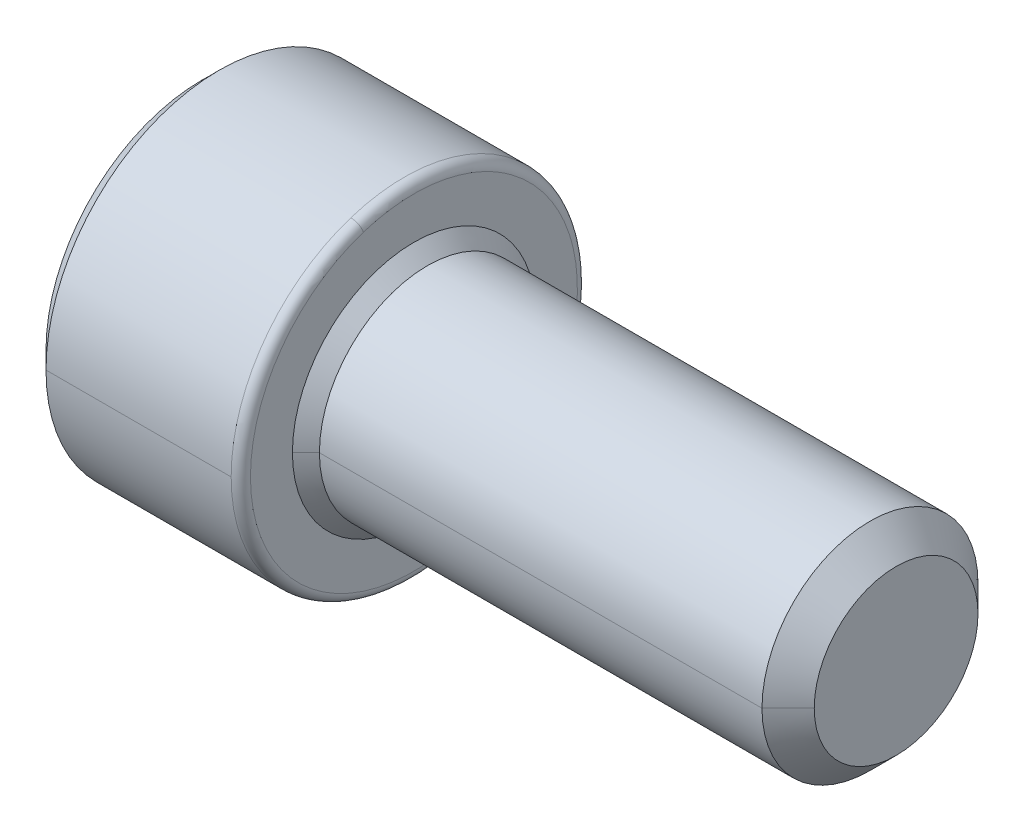
ISO-10303-21;
HEADER;
FILE_DESCRIPTION(('STEP AP214'),'2;1');
FILE_NAME('part.step','',(''),(''),'','','');
FILE_SCHEMA(('AUTOMOTIVE_DESIGN { 1 0 10303 214 1 1 1 1 }'));
ENDSEC;
DATA;
#1=APPLICATION_CONTEXT('core data for automotive mechanical design processes');
#2=APPLICATION_PROTOCOL_DEFINITION('international standard','automotive_design',2000,#1);
#3=PRODUCT_CONTEXT('',#1,'mechanical');
#4=PRODUCT('Part','Part','',(#3));
#5=PRODUCT_RELATED_PRODUCT_CATEGORY('part','',(#4));
#6=PRODUCT_DEFINITION_FORMATION('','',#4);
#7=PRODUCT_DEFINITION_CONTEXT('part definition',#1,'design');
#8=PRODUCT_DEFINITION('design','',#6,#7);
#9=PRODUCT_DEFINITION_SHAPE('','',#8);
#10=(LENGTH_UNIT() NAMED_UNIT(*) SI_UNIT(.MILLI.,.METRE.));
#11=(NAMED_UNIT(*) PLANE_ANGLE_UNIT() SI_UNIT($,.RADIAN.));
#12=(NAMED_UNIT(*) SI_UNIT($,.STERADIAN.) SOLID_ANGLE_UNIT());
#13=UNCERTAINTY_MEASURE_WITH_UNIT(LENGTH_MEASURE(1.E-05),#10,'distance_accuracy_value','');
#14=(GEOMETRIC_REPRESENTATION_CONTEXT(3) GLOBAL_UNCERTAINTY_ASSIGNED_CONTEXT((#13)) GLOBAL_UNIT_ASSIGNED_CONTEXT((#10,
#11,#12)) REPRESENTATION_CONTEXT('',''));
#15=CARTESIAN_POINT('',(0.,0.,0.));
#16=DIRECTION('',(0.,0.,1.));
#17=DIRECTION('',(1.,0.,0.));
#18=AXIS2_PLACEMENT_3D('',#15,#16,#17);
#19=CARTESIAN_POINT('',(-2.794,1.199515,0.));
#20=DIRECTION('',(1.,0.,0.));
#21=DIRECTION('',(0.,0.,-1.));
#22=AXIS2_PLACEMENT_3D('',#19,#20,#21);
#23=PLANE('',#22);
#24=CARTESIAN_POINT('',(-2.794,0.,0.));
#25=DIRECTION('',(1.,0.,0.));
#26=DIRECTION('',(0.,0.,-1.));
#27=AXIS2_PLACEMENT_3D('',#24,#25,#26);
#28=CIRCLE('',#27,2.05105);
#29=CARTESIAN_POINT('',(-2.794,0.,2.05105));
#30=VERTEX_POINT('',#29);
#31=CARTESIAN_POINT('',(-2.794,0.,-2.05105));
#32=VERTEX_POINT('',#31);
#33=EDGE_CURVE('E11',#30,#32,#28,.T.);
#34=ORIENTED_EDGE('',*,*,#33,.F.);
#35=CARTESIAN_POINT('',(-2.794,0.,0.));
#36=DIRECTION('',(1.,0.,0.));
#37=DIRECTION('',(0.,0.,-1.));
#38=AXIS2_PLACEMENT_3D('',#35,#36,#37);
#39=CIRCLE('',#38,2.05105);
#40=EDGE_CURVE('E25',#32,#30,#39,.T.);
#41=ORIENTED_EDGE('',*,*,#40,.F.);
#42=EDGE_LOOP('',(#34,#41));
#43=FACE_BOUND('',#42,.T.);
#44=DIRECTION('',(0.,-0.500000000000009,0.866025403784434));
#45=VECTOR('',#44,1.);
#46=CARTESIAN_POINT('',(-2.794,-0.738931712220478,-1.11916273111026));
#47=LINE('',#46,#45);
#48=CARTESIAN_POINT('',(-2.794,-0.69254030814699,-1.199515));
#49=VERTEX_POINT('',#48);
#50=CARTESIAN_POINT('',(-2.794,-1.385080616294,0.));
#51=VERTEX_POINT('',#50);
#52=EDGE_CURVE('E520',#49,#51,#47,.T.);
#53=ORIENTED_EDGE('',*,*,#52,.F.);
#54=DIRECTION('',(0.,-1.,0.));
#55=VECTOR('',#54,1.);
#56=CARTESIAN_POINT('',(-2.794,1.199515,-1.199515));
#57=LINE('',#56,#55);
#58=CARTESIAN_POINT('',(-2.794,0.69254030814699,-1.199515));
#59=VERTEX_POINT('',#58);
#60=EDGE_CURVE('E515',#59,#49,#57,.T.);
#61=ORIENTED_EDGE('',*,*,#60,.F.);
#62=DIRECTION('',(0.,-0.500000000000009,-0.866025403784434));
#63=VECTOR('',#62,1.);
#64=CARTESIAN_POINT('',(-2.794,1.3386892122205,-0.0803522688897606));
#65=LINE('',#64,#63);
#66=CARTESIAN_POINT('',(-2.794,1.385080616294,0.));
#67=VERTEX_POINT('',#66);
#68=EDGE_CURVE('E510',#67,#59,#65,.T.);
#69=ORIENTED_EDGE('',*,*,#68,.F.);
#70=DIRECTION('',(0.,0.500000000000009,-0.866025403784434));
#71=VECTOR('',#70,1.);
#72=CARTESIAN_POINT('',(-2.794,1.3386892122205,0.0803522688897606));
#73=LINE('',#72,#71);
#74=CARTESIAN_POINT('',(-2.794,0.69254030814699,1.199515));
#75=VERTEX_POINT('',#74);
#76=EDGE_CURVE('E505',#75,#67,#73,.T.);
#77=ORIENTED_EDGE('',*,*,#76,.F.);
#78=DIRECTION('',(0.,1.,0.));
#79=VECTOR('',#78,1.);
#80=CARTESIAN_POINT('',(-2.794,1.199515,1.199515));
#81=LINE('',#80,#79);
#82=CARTESIAN_POINT('',(-2.794,-0.69254030814699,1.199515));
#83=VERTEX_POINT('',#82);
#84=EDGE_CURVE('E500',#83,#75,#81,.T.);
#85=ORIENTED_EDGE('',*,*,#84,.F.);
#86=DIRECTION('',(0.,0.500000000000009,0.866025403784434));
#87=VECTOR('',#86,1.);
#88=CARTESIAN_POINT('',(-2.794,-0.738931712220478,1.11916273111026));
#89=LINE('',#88,#87);
#90=EDGE_CURVE('E495',#51,#83,#89,.T.);
#91=ORIENTED_EDGE('',*,*,#90,.F.);
#92=EDGE_LOOP('',(#53,#61,#69,#77,#85,#91));
#93=FACE_BOUND('',#92,.T.);
#94=ADVANCED_FACE('F17',(#43,#93),#23,.F.);
#95=CARTESIAN_POINT('',(-1.4986,-0.69254030814699,1.199515));
#96=DIRECTION('',(0.,0.866025403784434,-0.500000000000009));
#97=DIRECTION('',(0.,0.500000000000009,0.866025403784434));
#98=AXIS2_PLACEMENT_3D('',#95,#96,#97);
#99=PLANE('',#98);
#100=DIRECTION('',(0.,-0.500000000000009,-0.866025403784434));
#101=VECTOR('',#100,1.);
#102=CARTESIAN_POINT('',(-1.4986,-0.69254030814699,1.199515));
#103=LINE('',#102,#101);
#104=CARTESIAN_POINT('',(-1.4986,-0.69254030814699,1.199515));
#105=VERTEX_POINT('',#104);
#106=CARTESIAN_POINT('',(-1.4986,-1.03881046222049,0.599757500000012));
#107=VERTEX_POINT('',#106);
#108=EDGE_CURVE('E491',#105,#107,#103,.T.);
#109=ORIENTED_EDGE('',*,*,#108,.T.);
#110=DIRECTION('',(0.,-0.500000000000009,-0.866025403784434));
#111=VECTOR('',#110,1.);
#112=CARTESIAN_POINT('',(-1.4986,-0.69254030814699,1.199515));
#113=LINE('',#112,#111);
#114=CARTESIAN_POINT('',(-1.4986,-1.385080616294,0.));
#115=VERTEX_POINT('',#114);
#116=EDGE_CURVE('E487',#107,#115,#113,.T.);
#117=ORIENTED_EDGE('',*,*,#116,.T.);
#118=DIRECTION('',(-1.,0.,0.));
#119=VECTOR('',#118,1.);
#120=CARTESIAN_POINT('',(-1.4986,-1.385080616294,0.));
#121=LINE('',#120,#119);
#122=EDGE_CURVE('E482',#115,#51,#121,.T.);
#123=ORIENTED_EDGE('',*,*,#122,.T.);
#124=ORIENTED_EDGE('',*,*,#90,.T.);
#125=DIRECTION('',(-1.,0.,0.));
#126=VECTOR('',#125,1.);
#127=CARTESIAN_POINT('',(-1.4986,-0.69254030814699,1.199515));
#128=LINE('',#127,#126);
#129=EDGE_CURVE('E477',#105,#83,#128,.T.);
#130=ORIENTED_EDGE('',*,*,#129,.F.);
#131=EDGE_LOOP('',(#109,#117,#123,#124,#130));
#132=FACE_BOUND('',#131,.T.);
#133=ADVANCED_FACE('F569',(#132),#99,.T.);
#134=CARTESIAN_POINT('',(-1.4986,0.69254030814699,1.199515));
#135=DIRECTION('',(0.,0.,-1.));
#136=DIRECTION('',(-1.,0.,0.));
#137=AXIS2_PLACEMENT_3D('',#134,#135,#136);
#138=PLANE('',#137);
#139=DIRECTION('',(0.,-1.,0.));
#140=VECTOR('',#139,1.);
#141=CARTESIAN_POINT('',(-1.4986,0.69254030814699,1.199515));
#142=LINE('',#141,#140);
#143=CARTESIAN_POINT('',(-1.4986,0.69254030814699,1.199515));
#144=VERTEX_POINT('',#143);
#145=CARTESIAN_POINT('',(-1.4986,0.,1.199515));
#146=VERTEX_POINT('',#145);
#147=EDGE_CURVE('E473',#144,#146,#142,.T.);
#148=ORIENTED_EDGE('',*,*,#147,.T.);
#149=DIRECTION('',(0.,-1.,0.));
#150=VECTOR('',#149,1.);
#151=CARTESIAN_POINT('',(-1.4986,0.69254030814699,1.199515));
#152=LINE('',#151,#150);
#153=EDGE_CURVE('E468',#146,#105,#152,.T.);
#154=ORIENTED_EDGE('',*,*,#153,.T.);
#155=ORIENTED_EDGE('',*,*,#129,.T.);
#156=ORIENTED_EDGE('',*,*,#84,.T.);
#157=DIRECTION('',(-1.,0.,0.));
#158=VECTOR('',#157,1.);
#159=CARTESIAN_POINT('',(-1.4986,0.69254030814699,1.199515));
#160=LINE('',#159,#158);
#161=EDGE_CURVE('E463',#144,#75,#160,.T.);
#162=ORIENTED_EDGE('',*,*,#161,.F.);
#163=EDGE_LOOP('',(#148,#154,#155,#156,#162));
#164=FACE_BOUND('',#163,.T.);
#165=ADVANCED_FACE('F573',(#164),#138,.T.);
#166=CARTESIAN_POINT('',(-1.4986,1.385080616294,0.));
#167=DIRECTION('',(0.,-0.866025403784434,-0.500000000000009));
#168=DIRECTION('',(0.,0.500000000000009,-0.866025403784434));
#169=AXIS2_PLACEMENT_3D('',#166,#167,#168);
#170=PLANE('',#169);
#171=DIRECTION('',(0.,-0.500000000000009,0.866025403784434));
#172=VECTOR('',#171,1.);
#173=CARTESIAN_POINT('',(-1.4986,1.385080616294,0.));
#174=LINE('',#173,#172);
#175=CARTESIAN_POINT('',(-1.4986,1.385080616294,0.));
#176=VERTEX_POINT('',#175);
#177=CARTESIAN_POINT('',(-1.4986,1.03881046222049,0.599757500000012));
#178=VERTEX_POINT('',#177);
#179=EDGE_CURVE('E459',#176,#178,#174,.T.);
#180=ORIENTED_EDGE('',*,*,#179,.T.);
#181=DIRECTION('',(0.,-0.500000000000009,0.866025403784434));
#182=VECTOR('',#181,1.);
#183=CARTESIAN_POINT('',(-1.4986,1.385080616294,0.));
#184=LINE('',#183,#182);
#185=EDGE_CURVE('E454',#178,#144,#184,.T.);
#186=ORIENTED_EDGE('',*,*,#185,.T.);
#187=ORIENTED_EDGE('',*,*,#161,.T.);
#188=ORIENTED_EDGE('',*,*,#76,.T.);
#189=DIRECTION('',(-1.,0.,0.));
#190=VECTOR('',#189,1.);
#191=CARTESIAN_POINT('',(-1.4986,1.385080616294,0.));
#192=LINE('',#191,#190);
#193=EDGE_CURVE('E449',#176,#67,#192,.T.);
#194=ORIENTED_EDGE('',*,*,#193,.F.);
#195=EDGE_LOOP('',(#180,#186,#187,#188,#194));
#196=FACE_BOUND('',#195,.T.);
#197=ADVANCED_FACE('F588',(#196),#170,.T.);
#198=CARTESIAN_POINT('',(-1.4986,0.69254030814699,-1.199515));
#199=DIRECTION('',(0.,-0.866025403784434,0.500000000000009));
#200=DIRECTION('',(0.,-0.500000000000009,-0.866025403784434));
#201=AXIS2_PLACEMENT_3D('',#198,#199,#200);
#202=PLANE('',#201);
#203=DIRECTION('',(0.,0.500000000000009,0.866025403784434));
#204=VECTOR('',#203,1.);
#205=CARTESIAN_POINT('',(-1.4986,0.69254030814699,-1.199515));
#206=LINE('',#205,#204);
#207=CARTESIAN_POINT('',(-1.4986,0.69254030814699,-1.199515));
#208=VERTEX_POINT('',#207);
#209=CARTESIAN_POINT('',(-1.4986,1.03881046222049,-0.599757500000012));
#210=VERTEX_POINT('',#209);
#211=EDGE_CURVE('E445',#208,#210,#206,.T.);
#212=ORIENTED_EDGE('',*,*,#211,.T.);
#213=DIRECTION('',(0.,0.500000000000009,0.866025403784434));
#214=VECTOR('',#213,1.);
#215=CARTESIAN_POINT('',(-1.4986,0.69254030814699,-1.199515));
#216=LINE('',#215,#214);
#217=EDGE_CURVE('E440',#210,#176,#216,.T.);
#218=ORIENTED_EDGE('',*,*,#217,.T.);
#219=ORIENTED_EDGE('',*,*,#193,.T.);
#220=ORIENTED_EDGE('',*,*,#68,.T.);
#221=DIRECTION('',(-1.,0.,0.));
#222=VECTOR('',#221,1.);
#223=CARTESIAN_POINT('',(-1.4986,0.69254030814699,-1.199515));
#224=LINE('',#223,#222);
#225=EDGE_CURVE('E435',#208,#59,#224,.T.);
#226=ORIENTED_EDGE('',*,*,#225,.F.);
#227=EDGE_LOOP('',(#212,#218,#219,#220,#226));
#228=FACE_BOUND('',#227,.T.);
#229=ADVANCED_FACE('F586',(#228),#202,.T.);
#230=CARTESIAN_POINT('',(-1.4986,-0.69254030814699,-1.199515));
#231=DIRECTION('',(0.,0.,1.));
#232=DIRECTION('',(1.,0.,0.));
#233=AXIS2_PLACEMENT_3D('',#230,#231,#232);
#234=PLANE('',#233);
#235=DIRECTION('',(0.,1.,0.));
#236=VECTOR('',#235,1.);
#237=CARTESIAN_POINT('',(-1.4986,-0.69254030814699,-1.199515));
#238=LINE('',#237,#236);
#239=CARTESIAN_POINT('',(-1.4986,-0.69254030814699,-1.199515));
#240=VERTEX_POINT('',#239);
#241=CARTESIAN_POINT('',(-1.4986,0.,-1.199515));
#242=VERTEX_POINT('',#241);
#243=EDGE_CURVE('E431',#240,#242,#238,.T.);
#244=ORIENTED_EDGE('',*,*,#243,.T.);
#245=DIRECTION('',(0.,1.,0.));
#246=VECTOR('',#245,1.);
#247=CARTESIAN_POINT('',(-1.4986,-0.69254030814699,-1.199515));
#248=LINE('',#247,#246);
#249=EDGE_CURVE('E426',#242,#208,#248,.T.);
#250=ORIENTED_EDGE('',*,*,#249,.T.);
#251=ORIENTED_EDGE('',*,*,#225,.T.);
#252=ORIENTED_EDGE('',*,*,#60,.T.);
#253=DIRECTION('',(-1.,0.,0.));
#254=VECTOR('',#253,1.);
#255=CARTESIAN_POINT('',(-1.4986,-0.69254030814699,-1.199515));
#256=LINE('',#255,#254);
#257=EDGE_CURVE('E421',#240,#49,#256,.T.);
#258=ORIENTED_EDGE('',*,*,#257,.F.);
#259=EDGE_LOOP('',(#244,#250,#251,#252,#258));
#260=FACE_BOUND('',#259,.T.);
#261=ADVANCED_FACE('F582',(#260),#234,.T.);
#262=CARTESIAN_POINT('',(-1.4986,-1.385080616294,0.));
#263=DIRECTION('',(0.,0.866025403784434,0.500000000000009));
#264=DIRECTION('',(0.,-0.500000000000009,0.866025403784434));
#265=AXIS2_PLACEMENT_3D('',#262,#263,#264);
#266=PLANE('',#265);
#267=DIRECTION('',(0.,0.500000000000009,-0.866025403784434));
#268=VECTOR('',#267,1.);
#269=CARTESIAN_POINT('',(-1.4986,-1.385080616294,0.));
#270=LINE('',#269,#268);
#271=CARTESIAN_POINT('',(-1.4986,-1.03881046222049,-0.599757500000012));
#272=VERTEX_POINT('',#271);
#273=EDGE_CURVE('E417',#115,#272,#270,.T.);
#274=ORIENTED_EDGE('',*,*,#273,.T.);
#275=DIRECTION('',(0.,0.500000000000009,-0.866025403784434));
#276=VECTOR('',#275,1.);
#277=CARTESIAN_POINT('',(-1.4986,-1.385080616294,0.));
#278=LINE('',#277,#276);
#279=EDGE_CURVE('E412',#272,#240,#278,.T.);
#280=ORIENTED_EDGE('',*,*,#279,.T.);
#281=ORIENTED_EDGE('',*,*,#257,.T.);
#282=ORIENTED_EDGE('',*,*,#52,.T.);
#283=ORIENTED_EDGE('',*,*,#122,.F.);
#284=EDGE_LOOP('',(#274,#280,#281,#282,#283));
#285=FACE_BOUND('',#284,.T.);
#286=ADVANCED_FACE('F578',(#285),#266,.T.);
#287=CARTESIAN_POINT('',(-1.4986,0.,0.));
#288=DIRECTION('',(1.,0.,0.));
#289=DIRECTION('',(0.,0.,-1.));
#290=AXIS2_PLACEMENT_3D('',#287,#288,#289);
#291=PLANE('',#290);
#292=ORIENTED_EDGE('',*,*,#243,.F.);
#293=ORIENTED_EDGE('',*,*,#279,.F.);
#294=CARTESIAN_POINT('',(-1.4986,0.,0.));
#295=DIRECTION('',(1.,0.,0.));
#296=DIRECTION('',(0.,0.,-1.));
#297=AXIS2_PLACEMENT_3D('',#294,#295,#296);
#298=CIRCLE('',#297,1.199515);
#299=EDGE_CURVE('E407',#272,#242,#298,.T.);
#300=ORIENTED_EDGE('',*,*,#299,.T.);
#301=EDGE_LOOP('',(#292,#293,#300));
#302=FACE_BOUND('',#301,.T.);
#303=ADVANCED_FACE('F371',(#302),#291,.F.);
#304=CARTESIAN_POINT('',(-1.1523298459265,0.,0.));
#305=DIRECTION('',(-1.,0.,0.));
#306=DIRECTION('',(0.,1.,0.));
#307=AXIS2_PLACEMENT_3D('',#304,#305,#306);
#308=CONICAL_SURFACE('',#307,0.5997575,1.0471975511966);
#309=DIRECTION('',(-0.500000000000001,0.,-0.866025403784438));
#310=VECTOR('',#309,1.);
#311=CARTESIAN_POINT('',(-1.1523298459265,0.,-0.5997575));
#312=LINE('',#311,#310);
#313=CARTESIAN_POINT('',(-1.1523298459265,0.,-0.5997575));
#314=VERTEX_POINT('',#313);
#315=EDGE_CURVE('E402',#314,#242,#312,.T.);
#316=ORIENTED_EDGE('',*,*,#315,.T.);
#317=ORIENTED_EDGE('',*,*,#299,.F.);
#318=CARTESIAN_POINT('',(-1.4986,0.,0.));
#319=DIRECTION('',(1.,0.,0.));
#320=DIRECTION('',(0.,0.,-1.));
#321=AXIS2_PLACEMENT_3D('',#318,#319,#320);
#322=CIRCLE('',#321,1.199515);
#323=EDGE_CURVE('E397',#107,#272,#322,.T.);
#324=ORIENTED_EDGE('',*,*,#323,.F.);
#325=CARTESIAN_POINT('',(-1.4986,0.,0.));
#326=DIRECTION('',(1.,0.,0.));
#327=DIRECTION('',(0.,0.,-1.));
#328=AXIS2_PLACEMENT_3D('',#325,#326,#327);
#329=CIRCLE('',#328,1.199515);
#330=EDGE_CURVE('E392',#146,#107,#329,.T.);
#331=ORIENTED_EDGE('',*,*,#330,.F.);
#332=DIRECTION('',(-0.500000000000001,0.,0.866025403784438));
#333=VECTOR('',#332,1.);
#334=CARTESIAN_POINT('',(-1.1523298459265,0.,0.5997575));
#335=LINE('',#334,#333);
#336=CARTESIAN_POINT('',(-1.1523298459265,0.,0.5997575));
#337=VERTEX_POINT('',#336);
#338=EDGE_CURVE('E389',#337,#146,#335,.T.);
#339=ORIENTED_EDGE('',*,*,#338,.F.);
#340=CARTESIAN_POINT('',(-1.1523298459265,0.,0.));
#341=DIRECTION('',(1.,0.,0.));
#342=DIRECTION('',(0.,0.,1.));
#343=AXIS2_PLACEMENT_3D('',#340,#341,#342);
#344=CIRCLE('',#343,0.5997575);
#345=CARTESIAN_POINT('',(-1.15232984592637,-0.599757500000383,0.));
#346=VERTEX_POINT('',#345);
#347=EDGE_CURVE('E387',#337,#346,#344,.T.);
#348=ORIENTED_EDGE('',*,*,#347,.T.);
#349=CARTESIAN_POINT('',(-1.1523298459265,0.,0.));
#350=DIRECTION('',(1.,0.,0.));
#351=DIRECTION('',(0.,0.,-1.));
#352=AXIS2_PLACEMENT_3D('',#349,#350,#351);
#353=CIRCLE('',#352,0.5997575);
#354=EDGE_CURVE('E640',#346,#314,#353,.T.);
#355=ORIENTED_EDGE('',*,*,#354,.T.);
#356=EDGE_LOOP('',(#316,#317,#324,#331,#339,#348,#355));
#357=FACE_BOUND('',#356,.T.);
#358=ADVANCED_FACE('F366',(#357),#308,.F.);
#359=CARTESIAN_POINT('',(-2.19114030814813,-3.05799222749536E-13,0.));
#360=DIRECTION('',(1.,0.,0.));
#361=DIRECTION('',(0.,0.,1.));
#362=AXIS2_PLACEMENT_3D('',#359,#360,#361);
#363=SPHERICAL_SURFACE('',#362,1.19951500000114);
#364=CARTESIAN_POINT('',(-2.19114030814813,-3.05799222749536E-13,0.));
#365=DIRECTION('',(0.,0.,1.));
#366=DIRECTION('',(1.,0.,0.));
#367=AXIS2_PLACEMENT_3D('',#364,#365,#366);
#368=CIRCLE('',#367,1.19951500000114);
#369=CARTESIAN_POINT('',(-0.991625308146989,-3.05725773639272E-13,0.));
#370=VERTEX_POINT('',#369);
#371=CARTESIAN_POINT('',(-1.15232984592637,0.599757499999771,0.));
#372=VERTEX_POINT('',#371);
#373=EDGE_CURVE('E641',#370,#372,#368,.T.);
#374=ORIENTED_EDGE('',*,*,#373,.T.);
#375=CARTESIAN_POINT('',(-1.1523298459265,0.,0.));
#376=DIRECTION('',(1.,0.,0.));
#377=DIRECTION('',(0.,0.,-1.));
#378=AXIS2_PLACEMENT_3D('',#375,#376,#377);
#379=CIRCLE('',#378,0.5997575);
#380=EDGE_CURVE('E637',#314,#372,#379,.T.);
#381=ORIENTED_EDGE('',*,*,#380,.F.);
#382=ORIENTED_EDGE('',*,*,#354,.F.);
#383=CARTESIAN_POINT('',(-2.19114030814813,-3.05799222749536E-13,0.));
#384=DIRECTION('',(0.,0.,-1.));
#385=DIRECTION('',(1.,0.,0.));
#386=AXIS2_PLACEMENT_3D('',#383,#384,#385);
#387=CIRCLE('',#386,1.19951500000114);
#388=EDGE_CURVE('E341',#370,#346,#387,.T.);
#389=ORIENTED_EDGE('',*,*,#388,.F.);
#390=EDGE_LOOP('',(#374,#381,#382,#389));
#391=FACE_BOUND('',#390,.T.);
#392=ADVANCED_FACE('F361',(#391),#363,.F.);
#393=CARTESIAN_POINT('',(-2.19114030814813,-3.05799222749536E-13,0.));
#394=DIRECTION('',(1.,0.,0.));
#395=DIRECTION('',(0.,0.,-1.));
#396=AXIS2_PLACEMENT_3D('',#393,#394,#395);
#397=SPHERICAL_SURFACE('',#396,1.19951500000114);
#398=ORIENTED_EDGE('',*,*,#388,.T.);
#399=ORIENTED_EDGE('',*,*,#347,.F.);
#400=CARTESIAN_POINT('',(-1.1523298459265,0.,0.));
#401=DIRECTION('',(1.,0.,0.));
#402=DIRECTION('',(0.,0.,-1.));
#403=AXIS2_PLACEMENT_3D('',#400,#401,#402);
#404=CIRCLE('',#403,0.5997575);
#405=EDGE_CURVE('E336',#372,#337,#404,.T.);
#406=ORIENTED_EDGE('',*,*,#405,.F.);
#407=ORIENTED_EDGE('',*,*,#373,.F.);
#408=EDGE_LOOP('',(#398,#399,#406,#407));
#409=FACE_BOUND('',#408,.T.);
#410=ADVANCED_FACE('F350',(#409),#397,.F.);
#411=CARTESIAN_POINT('',(-1.1523298459265,0.,0.));
#412=DIRECTION('',(-1.,0.,0.));
#413=DIRECTION('',(0.,-1.,0.));
#414=AXIS2_PLACEMENT_3D('',#411,#412,#413);
#415=CONICAL_SURFACE('',#414,0.5997575,1.0471975511966);
#416=ORIENTED_EDGE('',*,*,#315,.F.);
#417=ORIENTED_EDGE('',*,*,#380,.T.);
#418=ORIENTED_EDGE('',*,*,#405,.T.);
#419=ORIENTED_EDGE('',*,*,#338,.T.);
#420=CARTESIAN_POINT('',(-1.4986,0.,0.));
#421=DIRECTION('',(1.,0.,0.));
#422=DIRECTION('',(0.,0.,-1.));
#423=AXIS2_PLACEMENT_3D('',#420,#421,#422);
#424=CIRCLE('',#423,1.199515);
#425=EDGE_CURVE('E331',#178,#146,#424,.T.);
#426=ORIENTED_EDGE('',*,*,#425,.F.);
#427=CARTESIAN_POINT('',(-1.4986,0.,0.));
#428=DIRECTION('',(1.,0.,0.));
#429=DIRECTION('',(0.,0.,-1.));
#430=AXIS2_PLACEMENT_3D('',#427,#428,#429);
#431=CIRCLE('',#430,1.199515);
#432=EDGE_CURVE('E326',#210,#178,#431,.T.);
#433=ORIENTED_EDGE('',*,*,#432,.F.);
#434=CARTESIAN_POINT('',(-1.4986,0.,0.));
#435=DIRECTION('',(1.,0.,0.));
#436=DIRECTION('',(0.,0.,-1.));
#437=AXIS2_PLACEMENT_3D('',#434,#435,#436);
#438=CIRCLE('',#437,1.199515);
#439=EDGE_CURVE('E321',#242,#210,#438,.T.);
#440=ORIENTED_EDGE('',*,*,#439,.F.);
#441=EDGE_LOOP('',(#416,#417,#418,#419,#426,#433,#440));
#442=FACE_BOUND('',#441,.T.);
#443=ADVANCED_FACE('F360',(#442),#415,.F.);
#444=CARTESIAN_POINT('',(-1.4986,0.,0.));
#445=DIRECTION('',(1.,0.,0.));
#446=DIRECTION('',(0.,0.,-1.));
#447=AXIS2_PLACEMENT_3D('',#444,#445,#446);
#448=PLANE('',#447);
#449=ORIENTED_EDGE('',*,*,#211,.F.);
#450=ORIENTED_EDGE('',*,*,#249,.F.);
#451=ORIENTED_EDGE('',*,*,#439,.T.);
#452=EDGE_LOOP('',(#449,#450,#451));
#453=FACE_BOUND('',#452,.T.);
#454=ADVANCED_FACE('F622',(#453),#448,.F.);
#455=CARTESIAN_POINT('',(-1.4986,0.,0.));
#456=DIRECTION('',(1.,0.,0.));
#457=DIRECTION('',(0.,0.,-1.));
#458=AXIS2_PLACEMENT_3D('',#455,#456,#457);
#459=PLANE('',#458);
#460=ORIENTED_EDGE('',*,*,#179,.F.);
#461=ORIENTED_EDGE('',*,*,#217,.F.);
#462=ORIENTED_EDGE('',*,*,#432,.T.);
#463=EDGE_LOOP('',(#460,#461,#462));
#464=FACE_BOUND('',#463,.T.);
#465=ADVANCED_FACE('F619',(#464),#459,.F.);
#466=CARTESIAN_POINT('',(-1.4986,0.,0.));
#467=DIRECTION('',(1.,0.,0.));
#468=DIRECTION('',(0.,0.,-1.));
#469=AXIS2_PLACEMENT_3D('',#466,#467,#468);
#470=PLANE('',#469);
#471=ORIENTED_EDGE('',*,*,#147,.F.);
#472=ORIENTED_EDGE('',*,*,#185,.F.);
#473=ORIENTED_EDGE('',*,*,#425,.T.);
#474=EDGE_LOOP('',(#471,#472,#473));
#475=FACE_BOUND('',#474,.T.);
#476=ADVANCED_FACE('F612',(#475),#470,.F.);
#477=CARTESIAN_POINT('',(-1.4986,0.,0.));
#478=DIRECTION('',(1.,0.,0.));
#479=DIRECTION('',(0.,0.,-1.));
#480=AXIS2_PLACEMENT_3D('',#477,#478,#479);
#481=PLANE('',#480);
#482=ORIENTED_EDGE('',*,*,#108,.F.);
#483=ORIENTED_EDGE('',*,*,#153,.F.);
#484=ORIENTED_EDGE('',*,*,#330,.T.);
#485=EDGE_LOOP('',(#482,#483,#484));
#486=FACE_BOUND('',#485,.T.);
#487=ADVANCED_FACE('F605',(#486),#481,.F.);
#488=CARTESIAN_POINT('',(-1.4986,0.,0.));
#489=DIRECTION('',(1.,0.,0.));
#490=DIRECTION('',(0.,0.,-1.));
#491=AXIS2_PLACEMENT_3D('',#488,#489,#490);
#492=PLANE('',#491);
#493=ORIENTED_EDGE('',*,*,#273,.F.);
#494=ORIENTED_EDGE('',*,*,#116,.F.);
#495=ORIENTED_EDGE('',*,*,#323,.T.);
#496=EDGE_LOOP('',(#493,#494,#495));
#497=FACE_BOUND('',#496,.T.);
#498=ADVANCED_FACE('F603',(#497),#492,.F.);
#499=CARTESIAN_POINT('',(-2.794,0.,0.));
#500=DIRECTION('',(1.,0.,0.));
#501=DIRECTION('',(0.,-1.,0.));
#502=AXIS2_PLACEMENT_3D('',#499,#500,#501);
#503=CONICAL_SURFACE('',#502,2.05105,0.785398163397451);
#504=DIRECTION('',(0.707106781186545,0.,0.70710678118655));
#505=VECTOR('',#504,1.);
#506=CARTESIAN_POINT('',(-2.794,0.,2.05105));
#507=LINE('',#506,#505);
#508=CARTESIAN_POINT('',(-2.5654,0.,2.27965));
#509=VERTEX_POINT('',#508);
#510=EDGE_CURVE('E317',#30,#509,#507,.T.);
#511=ORIENTED_EDGE('',*,*,#510,.T.);
#512=CARTESIAN_POINT('',(-2.5654,0.,0.));
#513=DIRECTION('',(1.,0.,0.));
#514=DIRECTION('',(0.,0.,-1.));
#515=AXIS2_PLACEMENT_3D('',#512,#513,#514);
#516=CIRCLE('',#515,2.27965);
#517=CARTESIAN_POINT('',(-2.5654,0.,-2.27965));
#518=VERTEX_POINT('',#517);
#519=EDGE_CURVE('E312',#518,#509,#516,.T.);
#520=ORIENTED_EDGE('',*,*,#519,.F.);
#521=DIRECTION('',(0.707106781186545,0.,-0.70710678118655));
#522=VECTOR('',#521,1.);
#523=CARTESIAN_POINT('',(-2.794,0.,-2.05105));
#524=LINE('',#523,#522);
#525=EDGE_CURVE('E307',#32,#518,#524,.T.);
#526=ORIENTED_EDGE('',*,*,#525,.F.);
#527=ORIENTED_EDGE('',*,*,#40,.T.);
#528=EDGE_LOOP('',(#511,#520,#526,#527));
#529=FACE_BOUND('',#528,.T.);
#530=ADVANCED_FACE('F530',(#529),#503,.T.);
#531=CARTESIAN_POINT('',(-2.794,0.,0.));
#532=DIRECTION('',(1.,0.,0.));
#533=DIRECTION('',(0.,1.,0.));
#534=AXIS2_PLACEMENT_3D('',#531,#532,#533);
#535=CONICAL_SURFACE('',#534,2.05105,0.785398163397451);
#536=ORIENTED_EDGE('',*,*,#510,.F.);
#537=ORIENTED_EDGE('',*,*,#33,.T.);
#538=ORIENTED_EDGE('',*,*,#525,.T.);
#539=CARTESIAN_POINT('',(-2.5654,0.,0.));
#540=DIRECTION('',(1.,0.,0.));
#541=DIRECTION('',(0.,0.,-1.));
#542=AXIS2_PLACEMENT_3D('',#539,#540,#541);
#543=CIRCLE('',#542,2.27965);
#544=EDGE_CURVE('E302',#509,#518,#543,.T.);
#545=ORIENTED_EDGE('',*,*,#544,.F.);
#546=EDGE_LOOP('',(#536,#537,#538,#545));
#547=FACE_BOUND('',#546,.T.);
#548=ADVANCED_FACE('F533',(#547),#535,.T.);
#549=CARTESIAN_POINT('',(6.35,0.,0.));
#550=DIRECTION('',(1.,0.,0.));
#551=DIRECTION('',(0.,1.,0.));
#552=AXIS2_PLACEMENT_3D('',#549,#550,#551);
#553=CYLINDRICAL_SURFACE('',#552,2.27965);
#554=DIRECTION('',(1.,0.,0.));
#555=VECTOR('',#554,1.);
#556=CARTESIAN_POINT('',(-2.5654,0.,2.27965));
#557=LINE('',#556,#555);
#558=CARTESIAN_POINT('',(-0.127000000000002,0.,2.27965));
#559=VERTEX_POINT('',#558);
#560=EDGE_CURVE('E297',#509,#559,#557,.T.);
#561=ORIENTED_EDGE('',*,*,#560,.F.);
#562=ORIENTED_EDGE('',*,*,#544,.T.);
#563=DIRECTION('',(1.,0.,0.));
#564=VECTOR('',#563,1.);
#565=CARTESIAN_POINT('',(-2.5654,0.,-2.27965));
#566=LINE('',#565,#564);
#567=CARTESIAN_POINT('',(-0.127,0.,-2.27965));
#568=VERTEX_POINT('',#567);
#569=EDGE_CURVE('E293',#518,#568,#566,.T.);
#570=ORIENTED_EDGE('',*,*,#569,.T.);
#571=CARTESIAN_POINT('',(-0.127,0.,0.));
#572=DIRECTION('',(1.,0.,0.));
#573=DIRECTION('',(0.,0.,-1.));
#574=AXIS2_PLACEMENT_3D('',#571,#572,#573);
#575=CIRCLE('',#574,2.27965);
#576=CARTESIAN_POINT('',(-0.127,-2.16807598737223,-0.704450591226844));
#577=VERTEX_POINT('',#576);
#578=EDGE_CURVE('E288',#577,#568,#575,.T.);
#579=ORIENTED_EDGE('',*,*,#578,.F.);
#580=CARTESIAN_POINT('',(-0.127,0.,0.));
#581=DIRECTION('',(1.,0.,0.));
#582=DIRECTION('',(0.,0.,-1.));
#583=AXIS2_PLACEMENT_3D('',#580,#581,#582);
#584=CIRCLE('',#583,2.27965);
#585=EDGE_CURVE('E283',#559,#577,#584,.T.);
#586=ORIENTED_EDGE('',*,*,#585,.F.);
#587=EDGE_LOOP('',(#561,#562,#570,#579,#586));
#588=FACE_BOUND('',#587,.T.);
#589=ADVANCED_FACE('F537',(#588),#553,.T.);
#590=CARTESIAN_POINT('',(-0.126999999999986,0.,0.));
#591=DIRECTION('',(1.,0.,0.));
#592=DIRECTION('',(0.,0.309016994374947,-0.951056516295154));
#593=AXIS2_PLACEMENT_3D('',#590,#591,#592);
#594=TOROIDAL_SURFACE('',#593,2.15265,0.126999999999986);
#595=CARTESIAN_POINT('',(-0.126999999999986,-2.04729180980276,-0.66520543294123));
#596=DIRECTION('',(0.,0.309016994374947,-0.951056516295154));
#597=DIRECTION('',(1.,0.,0.));
#598=AXIS2_PLACEMENT_3D('',#595,#596,#597);
#599=CIRCLE('',#598,0.126999999999986);
#600=CARTESIAN_POINT('',(0.,-2.04729180980276,-0.66520543294123));
#601=VERTEX_POINT('',#600);
#602=EDGE_CURVE('E279',#601,#577,#599,.T.);
#603=ORIENTED_EDGE('',*,*,#602,.F.);
#604=CARTESIAN_POINT('',(0.,0.,0.));
#605=DIRECTION('',(1.,0.,0.));
#606=DIRECTION('',(0.,0.,-1.));
#607=AXIS2_PLACEMENT_3D('',#604,#605,#606);
#608=CIRCLE('',#607,2.15265);
#609=CARTESIAN_POINT('',(0.,2.04729180980276,0.66520543294123));
#610=VERTEX_POINT('',#609);
#611=EDGE_CURVE('E274',#610,#601,#608,.T.);
#612=ORIENTED_EDGE('',*,*,#611,.F.);
#613=CARTESIAN_POINT('',(-0.126999999999986,2.04729180980276,0.66520543294123));
#614=DIRECTION('',(0.,-0.309016994374947,0.951056516295154));
#615=DIRECTION('',(1.,0.,0.));
#616=AXIS2_PLACEMENT_3D('',#613,#614,#615);
#617=CIRCLE('',#616,0.126999999999986);
#618=CARTESIAN_POINT('',(-0.127,2.16807598737223,0.704450591226844));
#619=VERTEX_POINT('',#618);
#620=EDGE_CURVE('E270',#610,#619,#617,.T.);
#621=ORIENTED_EDGE('',*,*,#620,.T.);
#622=CARTESIAN_POINT('',(-0.127,0.,0.));
#623=DIRECTION('',(1.,0.,0.));
#624=DIRECTION('',(0.,0.,-1.));
#625=AXIS2_PLACEMENT_3D('',#622,#623,#624);
#626=CIRCLE('',#625,2.27965);
#627=EDGE_CURVE('E265',#619,#559,#626,.T.);
#628=ORIENTED_EDGE('',*,*,#627,.T.);
#629=ORIENTED_EDGE('',*,*,#585,.T.);
#630=EDGE_LOOP('',(#603,#612,#621,#628,#629));
#631=FACE_BOUND('',#630,.T.);
#632=ADVANCED_FACE('F542',(#631),#594,.T.);
#633=CARTESIAN_POINT('',(6.35,0.,0.));
#634=DIRECTION('',(1.,0.,0.));
#635=DIRECTION('',(0.,-1.,0.));
#636=AXIS2_PLACEMENT_3D('',#633,#634,#635);
#637=CYLINDRICAL_SURFACE('',#636,2.27965);
#638=ORIENTED_EDGE('',*,*,#560,.T.);
#639=ORIENTED_EDGE('',*,*,#627,.F.);
#640=CARTESIAN_POINT('',(-0.127,0.,0.));
#641=DIRECTION('',(1.,0.,0.));
#642=DIRECTION('',(0.,0.,-1.));
#643=AXIS2_PLACEMENT_3D('',#640,#641,#642);
#644=CIRCLE('',#643,2.27965);
#645=EDGE_CURVE('E262',#568,#619,#644,.T.);
#646=ORIENTED_EDGE('',*,*,#645,.F.);
#647=ORIENTED_EDGE('',*,*,#569,.F.);
#648=ORIENTED_EDGE('',*,*,#519,.T.);
#649=EDGE_LOOP('',(#638,#639,#646,#647,#648));
#650=FACE_BOUND('',#649,.T.);
#651=ADVANCED_FACE('F242',(#650),#637,.T.);
#652=CARTESIAN_POINT('',(-0.126999999999986,0.,0.));
#653=DIRECTION('',(1.,0.,0.));
#654=DIRECTION('',(0.,-0.309016994374947,0.951056516295154));
#655=AXIS2_PLACEMENT_3D('',#652,#653,#654);
#656=TOROIDAL_SURFACE('',#655,2.15265,0.126999999999986);
#657=ORIENTED_EDGE('',*,*,#602,.T.);
#658=ORIENTED_EDGE('',*,*,#578,.T.);
#659=ORIENTED_EDGE('',*,*,#645,.T.);
#660=ORIENTED_EDGE('',*,*,#620,.F.);
#661=CARTESIAN_POINT('',(0.,-2.04729180980276,-0.66520543294123));
#662=CARTESIAN_POINT('',(0.,-1.83811547938592,-1.30809511434122));
#663=CARTESIAN_POINT('',(0.,-1.37760458440238,-1.8706798281531));
#664=CARTESIAN_POINT('',(0.,-0.703284097597105,-2.21338835169083));
#665=CARTESIAN_POINT('',(0.,0.747070005906254,-2.29924505829509));
#666=CARTESIAN_POINT('',(0.,1.86996581754952,-1.37728877093004));
#667=CARTESIAN_POINT('',(0.,2.21406353505979,-0.703676113808043));
#668=CARTESIAN_POINT('',(0.,2.25594567725246,0.0221459930326678));
#669=CARTESIAN_POINT('',(0.,2.04729180980276,0.66520543294123));
#670=B_SPLINE_CURVE_WITH_KNOTS('',5,(#661,#662,#663,#664,#665,#666,#667,#668,#669),
.UNSPECIFIED.,.F.,.F.,(6,3,6),(0.,1.5707963267949,3.14159265358979),.UNSPECIFIED.);
#671=EDGE_CURVE('E261',#601,#610,#670,.T.);
#672=ORIENTED_EDGE('',*,*,#671,.F.);
#673=EDGE_LOOP('',(#657,#658,#659,#660,#672));
#674=FACE_BOUND('',#673,.T.);
#675=ADVANCED_FACE('F236',(#674),#656,.T.);
#676=CARTESIAN_POINT('',(0.,2.15265,0.));
#677=DIRECTION('',(-1.,0.,0.));
#678=DIRECTION('',(0.,0.,1.));
#679=AXIS2_PLACEMENT_3D('',#676,#677,#678);
#680=PLANE('',#679);
#681=CARTESIAN_POINT('',(0.,0.,0.));
#682=DIRECTION('',(1.,0.,0.));
#683=DIRECTION('',(0.,0.,-1.));
#684=AXIS2_PLACEMENT_3D('',#681,#682,#683);
#685=CIRCLE('',#684,1.6002);
#686=CARTESIAN_POINT('',(0.,0.,1.6002));
#687=VERTEX_POINT('',#686);
#688=CARTESIAN_POINT('',(0.,0.,-1.6002));
#689=VERTEX_POINT('',#688);
#690=EDGE_CURVE('E544',#687,#689,#685,.T.);
#691=ORIENTED_EDGE('',*,*,#690,.F.);
#692=CARTESIAN_POINT('',(0.,0.,0.));
#693=DIRECTION('',(1.,0.,0.));
#694=DIRECTION('',(0.,0.,-1.));
#695=AXIS2_PLACEMENT_3D('',#692,#693,#694);
#696=CIRCLE('',#695,1.6002);
#697=EDGE_CURVE('E216',#689,#687,#696,.T.);
#698=ORIENTED_EDGE('',*,*,#697,.F.);
#699=EDGE_LOOP('',(#691,#698));
#700=FACE_BOUND('',#699,.T.);
#701=ORIENTED_EDGE('',*,*,#671,.T.);
#702=ORIENTED_EDGE('',*,*,#611,.T.);
#703=EDGE_LOOP('',(#701,#702));
#704=FACE_BOUND('',#703,.T.);
#705=ADVANCED_FACE('F225',(#700,#704),#680,.F.);
#706=CARTESIAN_POINT('',(0.,0.,0.));
#707=DIRECTION('',(-1.,0.,0.));
#708=DIRECTION('',(0.,-1.,0.));
#709=AXIS2_PLACEMENT_3D('',#706,#707,#708);
#710=CONICAL_SURFACE('',#709,1.6002,0.785398163397449);
#711=DIRECTION('',(-0.707106781186547,0.,-0.707106781186548));
#712=VECTOR('',#711,1.);
#713=CARTESIAN_POINT('',(0.1778,0.,-1.4224));
#714=LINE('',#713,#712);
#715=CARTESIAN_POINT('',(0.1778,0.,-1.4224));
#716=VERTEX_POINT('',#715);
#717=EDGE_CURVE('E211',#716,#689,#714,.T.);
#718=ORIENTED_EDGE('',*,*,#717,.T.);
#719=ORIENTED_EDGE('',*,*,#697,.T.);
#720=DIRECTION('',(-0.707106781186547,0.,0.707106781186548));
#721=VECTOR('',#720,1.);
#722=CARTESIAN_POINT('',(0.1778,0.,1.4224));
#723=LINE('',#722,#721);
#724=CARTESIAN_POINT('',(0.1778,0.,1.4224));
#725=VERTEX_POINT('',#724);
#726=EDGE_CURVE('E206',#725,#687,#723,.T.);
#727=ORIENTED_EDGE('',*,*,#726,.F.);
#728=CARTESIAN_POINT('',(0.1778,0.,0.));
#729=DIRECTION('',(1.,0.,0.));
#730=DIRECTION('',(0.,0.,-1.));
#731=AXIS2_PLACEMENT_3D('',#728,#729,#730);
#732=CIRCLE('',#731,1.4224);
#733=EDGE_CURVE('E201',#716,#725,#732,.T.);
#734=ORIENTED_EDGE('',*,*,#733,.F.);
#735=EDGE_LOOP('',(#718,#719,#727,#734));
#736=FACE_BOUND('',#735,.T.);
#737=ADVANCED_FACE('F235',(#736),#710,.T.);
#738=CARTESIAN_POINT('',(6.35,0.,0.));
#739=DIRECTION('',(1.,0.,0.));
#740=DIRECTION('',(0.,-1.,0.));
#741=AXIS2_PLACEMENT_3D('',#738,#739,#740);
#742=CYLINDRICAL_SURFACE('',#741,1.4224);
#743=DIRECTION('',(1.,0.,0.));
#744=VECTOR('',#743,1.);
#745=CARTESIAN_POINT('',(0.1778,0.,1.4224));
#746=LINE('',#745,#744);
#747=CARTESIAN_POINT('',(6.00583,0.,1.4224));
#748=VERTEX_POINT('',#747);
#749=EDGE_CURVE('E197',#725,#748,#746,.T.);
#750=ORIENTED_EDGE('',*,*,#749,.T.);
#751=CARTESIAN_POINT('',(6.00583,0.,0.));
#752=DIRECTION('',(1.,0.,0.));
#753=DIRECTION('',(0.,0.,-1.));
#754=AXIS2_PLACEMENT_3D('',#751,#752,#753);
#755=CIRCLE('',#754,1.4224);
#756=CARTESIAN_POINT('',(6.00583,0.,-1.4224));
#757=VERTEX_POINT('',#756);
#758=EDGE_CURVE('E170',#757,#748,#755,.T.);
#759=ORIENTED_EDGE('',*,*,#758,.F.);
#760=DIRECTION('',(1.,0.,0.));
#761=VECTOR('',#760,1.);
#762=CARTESIAN_POINT('',(0.1778,0.,-1.4224));
#763=LINE('',#762,#761);
#764=EDGE_CURVE('E189',#716,#757,#763,.T.);
#765=ORIENTED_EDGE('',*,*,#764,.F.);
#766=ORIENTED_EDGE('',*,*,#733,.T.);
#767=EDGE_LOOP('',(#750,#759,#765,#766));
#768=FACE_BOUND('',#767,.T.);
#769=ADVANCED_FACE('F560',(#768),#742,.T.);
#770=CARTESIAN_POINT('',(6.35,0.,0.));
#771=DIRECTION('',(1.,0.,0.));
#772=DIRECTION('',(0.,1.,0.));
#773=AXIS2_PLACEMENT_3D('',#770,#771,#772);
#774=CYLINDRICAL_SURFACE('',#773,1.4224);
#775=ORIENTED_EDGE('',*,*,#749,.F.);
#776=CARTESIAN_POINT('',(0.1778,0.,0.));
#777=DIRECTION('',(1.,0.,0.));
#778=DIRECTION('',(0.,0.,-1.));
#779=AXIS2_PLACEMENT_3D('',#776,#777,#778);
#780=CIRCLE('',#779,1.4224);
#781=EDGE_CURVE('E184',#725,#716,#780,.T.);
#782=ORIENTED_EDGE('',*,*,#781,.T.);
#783=ORIENTED_EDGE('',*,*,#764,.T.);
#784=CARTESIAN_POINT('',(6.00583,0.,0.));
#785=DIRECTION('',(1.,0.,0.));
#786=DIRECTION('',(0.,0.,-1.));
#787=AXIS2_PLACEMENT_3D('',#784,#785,#786);
#788=CIRCLE('',#787,1.4224);
#789=EDGE_CURVE('E180',#748,#757,#788,.T.);
#790=ORIENTED_EDGE('',*,*,#789,.F.);
#791=EDGE_LOOP('',(#775,#782,#783,#790));
#792=FACE_BOUND('',#791,.T.);
#793=ADVANCED_FACE('F558',(#792),#774,.T.);
#794=CARTESIAN_POINT('',(6.00583,0.,0.));
#795=DIRECTION('',(-1.,0.,0.));
#796=DIRECTION('',(0.,1.,0.));
#797=AXIS2_PLACEMENT_3D('',#794,#795,#796);
#798=CONICAL_SURFACE('',#797,1.4224,0.785398163397448);
#799=DIRECTION('',(-0.707106781186548,0.,-0.707106781186547));
#800=VECTOR('',#799,1.);
#801=CARTESIAN_POINT('',(6.35,0.,-1.07823));
#802=LINE('',#801,#800);
#803=CARTESIAN_POINT('',(6.35,0.,-1.07823));
#804=VERTEX_POINT('',#803);
#805=EDGE_CURVE('E161',#804,#757,#802,.T.);
#806=ORIENTED_EDGE('',*,*,#805,.F.);
#807=CARTESIAN_POINT('',(6.35,0.,0.));
#808=DIRECTION('',(1.,0.,0.));
#809=DIRECTION('',(0.,0.,-1.));
#810=AXIS2_PLACEMENT_3D('',#807,#808,#809);
#811=CIRCLE('',#810,1.07823);
#812=CARTESIAN_POINT('',(6.35,0.,1.07823));
#813=VERTEX_POINT('',#812);
#814=EDGE_CURVE('E153',#813,#804,#811,.T.);
#815=ORIENTED_EDGE('',*,*,#814,.F.);
#816=DIRECTION('',(-0.707106781186548,0.,0.707106781186547));
#817=VECTOR('',#816,1.);
#818=CARTESIAN_POINT('',(6.35,0.,1.07823));
#819=LINE('',#818,#817);
#820=EDGE_CURVE('E158',#813,#748,#819,.T.);
#821=ORIENTED_EDGE('',*,*,#820,.T.);
#822=ORIENTED_EDGE('',*,*,#789,.T.);
#823=EDGE_LOOP('',(#806,#815,#821,#822));
#824=FACE_BOUND('',#823,.T.);
#825=ADVANCED_FACE('F155',(#824),#798,.T.);
#826=CARTESIAN_POINT('',(6.00583,0.,0.));
#827=DIRECTION('',(-1.,0.,0.));
#828=DIRECTION('',(0.,-1.,0.));
#829=AXIS2_PLACEMENT_3D('',#826,#827,#828);
#830=CONICAL_SURFACE('',#829,1.4224,0.785398163397448);
#831=ORIENTED_EDGE('',*,*,#805,.T.);
#832=ORIENTED_EDGE('',*,*,#758,.T.);
#833=ORIENTED_EDGE('',*,*,#820,.F.);
#834=CARTESIAN_POINT('',(6.35,0.,0.));
#835=DIRECTION('',(1.,0.,0.));
#836=DIRECTION('',(0.,0.,-1.));
#837=AXIS2_PLACEMENT_3D('',#834,#835,#836);
#838=CIRCLE('',#837,1.07823);
#839=EDGE_CURVE('E165',#804,#813,#838,.T.);
#840=ORIENTED_EDGE('',*,*,#839,.F.);
#841=EDGE_LOOP('',(#831,#832,#833,#840));
#842=FACE_BOUND('',#841,.T.);
#843=ADVANCED_FACE('F169',(#842),#830,.T.);
#844=CARTESIAN_POINT('',(6.35,1.07823,0.));
#845=DIRECTION('',(-1.,0.,0.));
#846=DIRECTION('',(0.,0.,1.));
#847=AXIS2_PLACEMENT_3D('',#844,#845,#846);
#848=PLANE('',#847);
#849=ORIENTED_EDGE('',*,*,#839,.T.);
#850=ORIENTED_EDGE('',*,*,#814,.T.);
#851=EDGE_LOOP('',(#849,#850));
#852=FACE_BOUND('',#851,.T.);
#853=ADVANCED_FACE('F166',(#852),#848,.F.);
#854=CARTESIAN_POINT('',(0.,0.,0.));
#855=DIRECTION('',(-1.,0.,0.));
#856=DIRECTION('',(0.,1.,0.));
#857=AXIS2_PLACEMENT_3D('',#854,#855,#856);
#858=CONICAL_SURFACE('',#857,1.6002,0.785398163397449);
#859=ORIENTED_EDGE('',*,*,#717,.F.);
#860=ORIENTED_EDGE('',*,*,#781,.F.);
#861=ORIENTED_EDGE('',*,*,#726,.T.);
#862=ORIENTED_EDGE('',*,*,#690,.T.);
#863=EDGE_LOOP('',(#859,#860,#861,#862));
#864=FACE_BOUND('',#863,.T.);
#865=ADVANCED_FACE('F553',(#864),#858,.T.);
#866=CLOSED_SHELL('',(#94,#133,#165,#197,#229,#261,#286,#303,#358,#392,#410,#443,#454,#465,#476,
#487,#498,#530,#548,#589,#632,#651,#675,#705,#737,#769,#793,#825,#843,#853,#865));
#867=MANIFOLD_SOLID_BREP('B1',#866);
#868=ADVANCED_BREP_SHAPE_REPRESENTATION('',(#18,#867),#14);
#869=SHAPE_DEFINITION_REPRESENTATION(#9,#868);
ENDSEC;
END-ISO-10303-21;
